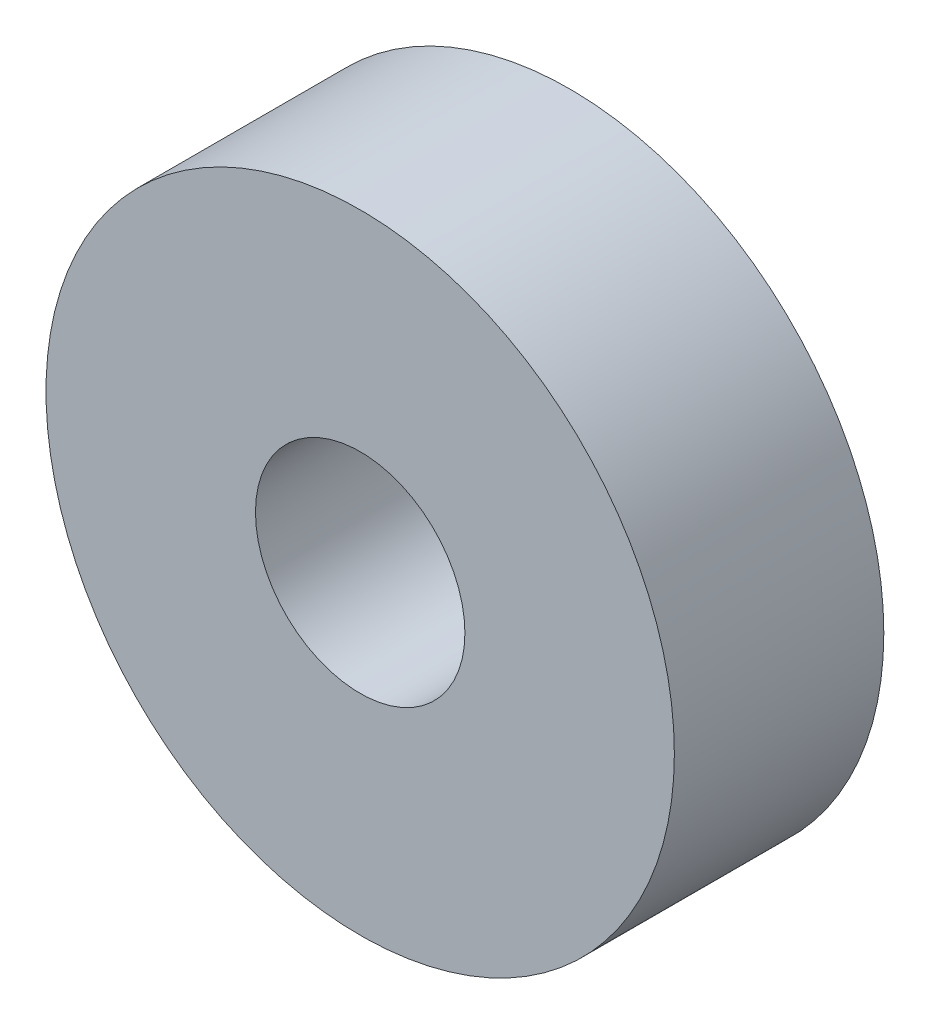
ISO-10303-21;
HEADER;
FILE_DESCRIPTION(('STEP AP214'),'2;1');
FILE_NAME('part.step','',(''),(''),'','','');
FILE_SCHEMA(('AUTOMOTIVE_DESIGN { 1 0 10303 214 1 1 1 1 }'));
ENDSEC;
DATA;
#1=APPLICATION_CONTEXT('core data for automotive mechanical design processes');
#2=APPLICATION_PROTOCOL_DEFINITION('international standard','automotive_design',2000,#1);
#3=PRODUCT_CONTEXT('',#1,'mechanical');
#4=PRODUCT('Part','Part','',(#3));
#5=PRODUCT_RELATED_PRODUCT_CATEGORY('part','',(#4));
#6=PRODUCT_DEFINITION_FORMATION('','',#4);
#7=PRODUCT_DEFINITION_CONTEXT('part definition',#1,'design');
#8=PRODUCT_DEFINITION('design','',#6,#7);
#9=PRODUCT_DEFINITION_SHAPE('','',#8);
#10=(LENGTH_UNIT() NAMED_UNIT(*) SI_UNIT(.MILLI.,.METRE.));
#11=(NAMED_UNIT(*) PLANE_ANGLE_UNIT() SI_UNIT($,.RADIAN.));
#12=(NAMED_UNIT(*) SI_UNIT($,.STERADIAN.) SOLID_ANGLE_UNIT());
#13=UNCERTAINTY_MEASURE_WITH_UNIT(LENGTH_MEASURE(1.E-05),#10,'distance_accuracy_value','');
#14=(GEOMETRIC_REPRESENTATION_CONTEXT(3) GLOBAL_UNCERTAINTY_ASSIGNED_CONTEXT((#13)) GLOBAL_UNIT_ASSIGNED_CONTEXT((#10,
#11,#12)) REPRESENTATION_CONTEXT('',''));
#15=CARTESIAN_POINT('',(0.,0.,0.));
#16=DIRECTION('',(0.,0.,1.));
#17=DIRECTION('',(1.,0.,0.));
#18=AXIS2_PLACEMENT_3D('',#15,#16,#17);
#19=CARTESIAN_POINT('',(0.,0.,20.));
#20=DIRECTION('',(0.,0.,1.));
#21=DIRECTION('',(1.,0.,0.));
#22=AXIS2_PLACEMENT_3D('',#19,#20,#21);
#23=PLANE('',#22);
#24=CARTESIAN_POINT('',(0.,0.,20.));
#25=DIRECTION('',(0.,0.,1.));
#26=DIRECTION('',(1.,0.,0.));
#27=AXIS2_PLACEMENT_3D('',#24,#25,#26);
#28=CIRCLE('',#27,60.);
#29=CARTESIAN_POINT('',(60.,0.,20.));
#30=VERTEX_POINT('',#29);
#31=EDGE_CURVE('E10',#30,#30,#28,.T.);
#32=ORIENTED_EDGE('',*,*,#31,.T.);
#33=EDGE_LOOP('',(#32));
#34=FACE_BOUND('',#33,.T.);
#35=CARTESIAN_POINT('',(0.,0.,20.));
#36=DIRECTION('',(0.,0.,1.));
#37=DIRECTION('',(1.,0.,0.));
#38=AXIS2_PLACEMENT_3D('',#35,#36,#37);
#39=CIRCLE('',#38,20.);
#40=CARTESIAN_POINT('',(20.,0.,20.));
#41=VERTEX_POINT('',#40);
#42=EDGE_CURVE('E45',#41,#41,#39,.T.);
#43=ORIENTED_EDGE('',*,*,#42,.F.);
#44=EDGE_LOOP('',(#43));
#45=FACE_BOUND('',#44,.T.);
#46=ADVANCED_FACE('F34',(#34,#45),#23,.T.);
#47=CARTESIAN_POINT('',(0.,0.,-20.));
#48=DIRECTION('',(0.,0.,1.));
#49=DIRECTION('',(1.,0.,0.));
#50=AXIS2_PLACEMENT_3D('',#47,#48,#49);
#51=PLANE('',#50);
#52=CARTESIAN_POINT('',(0.,0.,-20.));
#53=DIRECTION('',(0.,0.,1.));
#54=DIRECTION('',(1.,0.,0.));
#55=AXIS2_PLACEMENT_3D('',#52,#53,#54);
#56=CIRCLE('',#55,60.);
#57=CARTESIAN_POINT('',(60.,0.,-20.));
#58=VERTEX_POINT('',#57);
#59=EDGE_CURVE('E38',#58,#58,#56,.T.);
#60=ORIENTED_EDGE('',*,*,#59,.F.);
#61=EDGE_LOOP('',(#60));
#62=FACE_BOUND('',#61,.T.);
#63=CARTESIAN_POINT('',(0.,0.,-20.));
#64=DIRECTION('',(0.,0.,1.));
#65=DIRECTION('',(1.,0.,0.));
#66=AXIS2_PLACEMENT_3D('',#63,#64,#65);
#67=CIRCLE('',#66,20.);
#68=CARTESIAN_POINT('',(20.,0.,-20.));
#69=VERTEX_POINT('',#68);
#70=EDGE_CURVE('E47',#69,#69,#67,.T.);
#71=ORIENTED_EDGE('',*,*,#70,.T.);
#72=EDGE_LOOP('',(#71));
#73=FACE_BOUND('',#72,.T.);
#74=ADVANCED_FACE('F57',(#62,#73),#51,.F.);
#75=CARTESIAN_POINT('',(0.,0.,20.));
#76=DIRECTION('',(0.,0.,-1.));
#77=DIRECTION('',(-1.,0.,0.));
#78=AXIS2_PLACEMENT_3D('',#75,#76,#77);
#79=CYLINDRICAL_SURFACE('',#78,60.);
#80=ORIENTED_EDGE('',*,*,#31,.F.);
#81=EDGE_LOOP('',(#80));
#82=FACE_BOUND('',#81,.T.);
#83=ORIENTED_EDGE('',*,*,#59,.T.);
#84=EDGE_LOOP('',(#83));
#85=FACE_BOUND('',#84,.T.);
#86=ADVANCED_FACE('F36',(#82,#85),#79,.T.);
#87=CARTESIAN_POINT('',(0.,0.,20.));
#88=DIRECTION('',(0.,0.,-1.));
#89=DIRECTION('',(-1.,0.,0.));
#90=AXIS2_PLACEMENT_3D('',#87,#88,#89);
#91=CYLINDRICAL_SURFACE('',#90,20.);
#92=ORIENTED_EDGE('',*,*,#42,.T.);
#93=EDGE_LOOP('',(#92));
#94=FACE_BOUND('',#93,.T.);
#95=ORIENTED_EDGE('',*,*,#70,.F.);
#96=EDGE_LOOP('',(#95));
#97=FACE_BOUND('',#96,.T.);
#98=ADVANCED_FACE('F53',(#94,#97),#91,.F.);
#99=CLOSED_SHELL('',(#46,#74,#86,#98));
#100=MANIFOLD_SOLID_BREP('B2',#99);
#101=ADVANCED_BREP_SHAPE_REPRESENTATION('',(#18,#100),#14);
#102=SHAPE_DEFINITION_REPRESENTATION(#9,#101);
ENDSEC;
END-ISO-10303-21;
